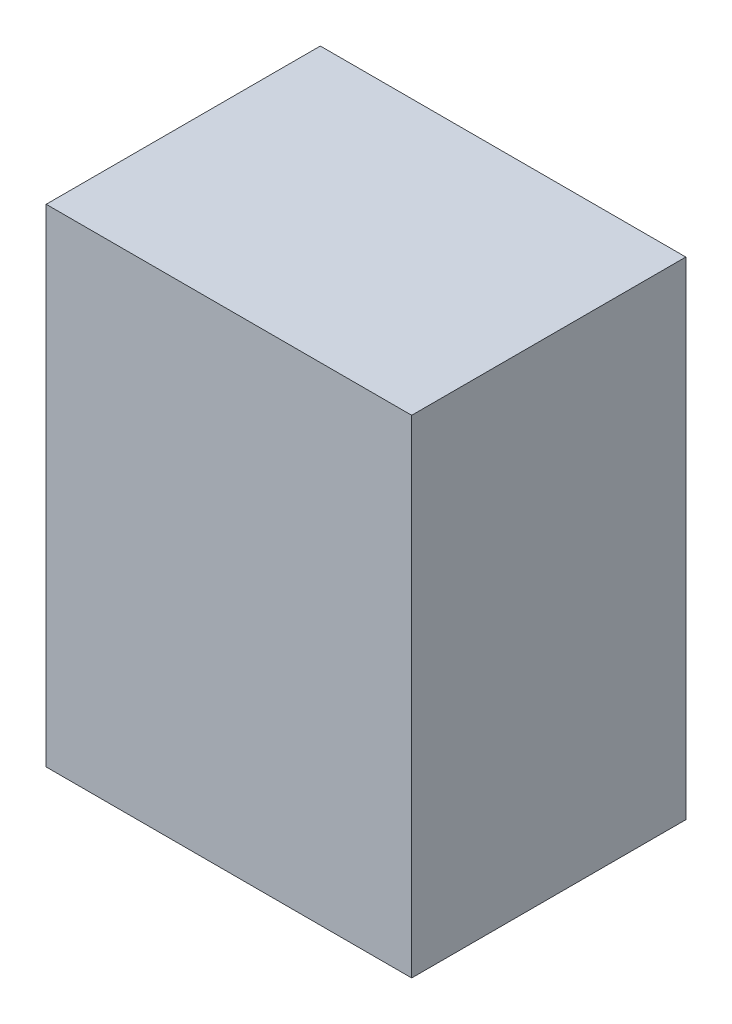
ISO-10303-21;
HEADER;
FILE_DESCRIPTION(('STEP AP214'),'2;1');
FILE_NAME('part.step','',(''),(''),'','','');
FILE_SCHEMA(('AUTOMOTIVE_DESIGN { 1 0 10303 214 1 1 1 1 }'));
ENDSEC;
DATA;
#1=APPLICATION_CONTEXT('core data for automotive mechanical design processes');
#2=APPLICATION_PROTOCOL_DEFINITION('international standard','automotive_design',2000,#1);
#3=PRODUCT_CONTEXT('',#1,'mechanical');
#4=PRODUCT('Part','Part','',(#3));
#5=PRODUCT_RELATED_PRODUCT_CATEGORY('part','',(#4));
#6=PRODUCT_DEFINITION_FORMATION('','',#4);
#7=PRODUCT_DEFINITION_CONTEXT('part definition',#1,'design');
#8=PRODUCT_DEFINITION('design','',#6,#7);
#9=PRODUCT_DEFINITION_SHAPE('','',#8);
#10=(LENGTH_UNIT() NAMED_UNIT(*) SI_UNIT(.MILLI.,.METRE.));
#11=(NAMED_UNIT(*) PLANE_ANGLE_UNIT() SI_UNIT($,.RADIAN.));
#12=(NAMED_UNIT(*) SI_UNIT($,.STERADIAN.) SOLID_ANGLE_UNIT());
#13=UNCERTAINTY_MEASURE_WITH_UNIT(LENGTH_MEASURE(1.E-05),#10,'distance_accuracy_value','');
#14=(GEOMETRIC_REPRESENTATION_CONTEXT(3) GLOBAL_UNCERTAINTY_ASSIGNED_CONTEXT((#13)) GLOBAL_UNIT_ASSIGNED_CONTEXT((#10,
#11,#12)) REPRESENTATION_CONTEXT('',''));
#15=CARTESIAN_POINT('',(0.,0.,0.));
#16=DIRECTION('',(0.,0.,1.));
#17=DIRECTION('',(1.,0.,0.));
#18=AXIS2_PLACEMENT_3D('',#15,#16,#17);
#19=CARTESIAN_POINT('',(0.90000074,-1.20000014,0.));
#20=DIRECTION('',(0.,-1.,0.));
#21=DIRECTION('',(-1.,0.,0.));
#22=AXIS2_PLACEMENT_3D('',#19,#20,#21);
#23=PLANE('',#22);
#24=DIRECTION('',(0.,0.,1.));
#25=VECTOR('',#24,1.);
#26=CARTESIAN_POINT('',(0.90000074,-1.20000014,0.));
#27=LINE('',#26,#25);
#28=CARTESIAN_POINT('',(0.90000074,-1.20000014,0.));
#29=VERTEX_POINT('',#28);
#30=CARTESIAN_POINT('',(0.90000074,-1.20000014,1.34999984));
#31=VERTEX_POINT('',#30);
#32=EDGE_CURVE('E11',#29,#31,#27,.T.);
#33=ORIENTED_EDGE('',*,*,#32,.T.);
#34=DIRECTION('',(-1.,0.,0.));
#35=VECTOR('',#34,1.);
#36=CARTESIAN_POINT('',(0.90000074,-1.20000014,1.34999984));
#37=LINE('',#36,#35);
#38=CARTESIAN_POINT('',(-0.8999982,-1.20000014,1.34999984));
#39=VERTEX_POINT('',#38);
#40=EDGE_CURVE('E24',#31,#39,#37,.T.);
#41=ORIENTED_EDGE('',*,*,#40,.T.);
#42=DIRECTION('',(0.,0.,1.));
#43=VECTOR('',#42,1.);
#44=CARTESIAN_POINT('',(-0.8999982,-1.20000014,0.));
#45=LINE('',#44,#43);
#46=CARTESIAN_POINT('',(-0.8999982,-1.20000014,0.));
#47=VERTEX_POINT('',#46);
#48=EDGE_CURVE('E85',#47,#39,#45,.T.);
#49=ORIENTED_EDGE('',*,*,#48,.F.);
#50=DIRECTION('',(-1.,0.,0.));
#51=VECTOR('',#50,1.);
#52=CARTESIAN_POINT('',(0.90000074,-1.20000014,0.));
#53=LINE('',#52,#51);
#54=EDGE_CURVE('E83',#29,#47,#53,.T.);
#55=ORIENTED_EDGE('',*,*,#54,.F.);
#56=EDGE_LOOP('',(#33,#41,#49,#55));
#57=FACE_BOUND('',#56,.T.);
#58=ADVANCED_FACE('F17',(#57),#23,.T.);
#59=CARTESIAN_POINT('',(-0.8999982,-1.20000014,0.));
#60=DIRECTION('',(-1.,0.,0.));
#61=DIRECTION('',(0.,1.,0.));
#62=AXIS2_PLACEMENT_3D('',#59,#60,#61);
#63=PLANE('',#62);
#64=ORIENTED_EDGE('',*,*,#48,.T.);
#65=DIRECTION('',(0.,1.,0.));
#66=VECTOR('',#65,1.);
#67=CARTESIAN_POINT('',(-0.8999982,-1.20000014,1.34999984));
#68=LINE('',#67,#66);
#69=CARTESIAN_POINT('',(-0.8999982,1.20000014,1.34999984));
#70=VERTEX_POINT('',#69);
#71=EDGE_CURVE('E81',#39,#70,#68,.T.);
#72=ORIENTED_EDGE('',*,*,#71,.T.);
#73=DIRECTION('',(0.,0.,1.));
#74=VECTOR('',#73,1.);
#75=CARTESIAN_POINT('',(-0.8999982,1.20000014,0.));
#76=LINE('',#75,#74);
#77=CARTESIAN_POINT('',(-0.8999982,1.20000014,0.));
#78=VERTEX_POINT('',#77);
#79=EDGE_CURVE('E79',#78,#70,#76,.T.);
#80=ORIENTED_EDGE('',*,*,#79,.F.);
#81=DIRECTION('',(0.,1.,0.));
#82=VECTOR('',#81,1.);
#83=CARTESIAN_POINT('',(-0.8999982,-1.20000014,0.));
#84=LINE('',#83,#82);
#85=EDGE_CURVE('E70',#47,#78,#84,.T.);
#86=ORIENTED_EDGE('',*,*,#85,.F.);
#87=EDGE_LOOP('',(#64,#72,#80,#86));
#88=FACE_BOUND('',#87,.T.);
#89=ADVANCED_FACE('F90',(#88),#63,.T.);
#90=CARTESIAN_POINT('',(-0.8999982,1.20000014,0.));
#91=DIRECTION('',(0.,1.,0.));
#92=DIRECTION('',(1.,0.,0.));
#93=AXIS2_PLACEMENT_3D('',#90,#91,#92);
#94=PLANE('',#93);
#95=ORIENTED_EDGE('',*,*,#79,.T.);
#96=DIRECTION('',(1.,0.,0.));
#97=VECTOR('',#96,1.);
#98=CARTESIAN_POINT('',(-0.8999982,1.20000014,1.34999984));
#99=LINE('',#98,#97);
#100=CARTESIAN_POINT('',(0.90000074,1.20000014,1.34999984));
#101=VERTEX_POINT('',#100);
#102=EDGE_CURVE('E60',#70,#101,#99,.T.);
#103=ORIENTED_EDGE('',*,*,#102,.T.);
#104=DIRECTION('',(0.,0.,1.));
#105=VECTOR('',#104,1.);
#106=CARTESIAN_POINT('',(0.90000074,1.20000014,0.));
#107=LINE('',#106,#105);
#108=CARTESIAN_POINT('',(0.90000074,1.20000014,0.));
#109=VERTEX_POINT('',#108);
#110=EDGE_CURVE('E54',#109,#101,#107,.T.);
#111=ORIENTED_EDGE('',*,*,#110,.F.);
#112=DIRECTION('',(1.,0.,0.));
#113=VECTOR('',#112,1.);
#114=CARTESIAN_POINT('',(-0.8999982,1.20000014,0.));
#115=LINE('',#114,#113);
#116=EDGE_CURVE('E58',#78,#109,#115,.T.);
#117=ORIENTED_EDGE('',*,*,#116,.F.);
#118=EDGE_LOOP('',(#95,#103,#111,#117));
#119=FACE_BOUND('',#118,.T.);
#120=ADVANCED_FACE('F57',(#119),#94,.T.);
#121=CARTESIAN_POINT('',(0.90000074,1.20000014,0.));
#122=DIRECTION('',(1.,0.,0.));
#123=DIRECTION('',(0.,-1.,0.));
#124=AXIS2_PLACEMENT_3D('',#121,#122,#123);
#125=PLANE('',#124);
#126=ORIENTED_EDGE('',*,*,#110,.T.);
#127=DIRECTION('',(0.,-1.,0.));
#128=VECTOR('',#127,1.);
#129=CARTESIAN_POINT('',(0.90000074,1.20000014,1.34999984));
#130=LINE('',#129,#128);
#131=EDGE_CURVE('E71',#101,#31,#130,.T.);
#132=ORIENTED_EDGE('',*,*,#131,.T.);
#133=ORIENTED_EDGE('',*,*,#32,.F.);
#134=DIRECTION('',(0.,-1.,0.));
#135=VECTOR('',#134,1.);
#136=CARTESIAN_POINT('',(0.90000074,1.20000014,0.));
#137=LINE('',#136,#135);
#138=EDGE_CURVE('E68',#109,#29,#137,.T.);
#139=ORIENTED_EDGE('',*,*,#138,.F.);
#140=EDGE_LOOP('',(#126,#132,#133,#139));
#141=FACE_BOUND('',#140,.T.);
#142=ADVANCED_FACE('F73',(#141),#125,.T.);
#143=CARTESIAN_POINT('',(0.90000074,-1.20000014,0.));
#144=DIRECTION('',(0.,0.,1.));
#145=DIRECTION('',(1.,0.,0.));
#146=AXIS2_PLACEMENT_3D('',#143,#144,#145);
#147=PLANE('',#146);
#148=ORIENTED_EDGE('',*,*,#54,.T.);
#149=ORIENTED_EDGE('',*,*,#85,.T.);
#150=ORIENTED_EDGE('',*,*,#116,.T.);
#151=ORIENTED_EDGE('',*,*,#138,.T.);
#152=EDGE_LOOP('',(#148,#149,#150,#151));
#153=FACE_BOUND('',#152,.T.);
#154=ADVANCED_FACE('F67',(#153),#147,.F.);
#155=CARTESIAN_POINT('',(0.90000074,-1.20000014,1.34999984));
#156=DIRECTION('',(0.,0.,1.));
#157=DIRECTION('',(1.,0.,0.));
#158=AXIS2_PLACEMENT_3D('',#155,#156,#157);
#159=PLANE('',#158);
#160=ORIENTED_EDGE('',*,*,#131,.F.);
#161=ORIENTED_EDGE('',*,*,#102,.F.);
#162=ORIENTED_EDGE('',*,*,#71,.F.);
#163=ORIENTED_EDGE('',*,*,#40,.F.);
#164=EDGE_LOOP('',(#160,#161,#162,#163));
#165=FACE_BOUND('',#164,.T.);
#166=ADVANCED_FACE('F91',(#165),#159,.T.);
#167=CLOSED_SHELL('',(#58,#89,#120,#142,#154,#166));
#168=MANIFOLD_SOLID_BREP('B1',#167);
#169=ADVANCED_BREP_SHAPE_REPRESENTATION('',(#18,#168),#14);
#170=SHAPE_DEFINITION_REPRESENTATION(#9,#169);
ENDSEC;
END-ISO-10303-21;
